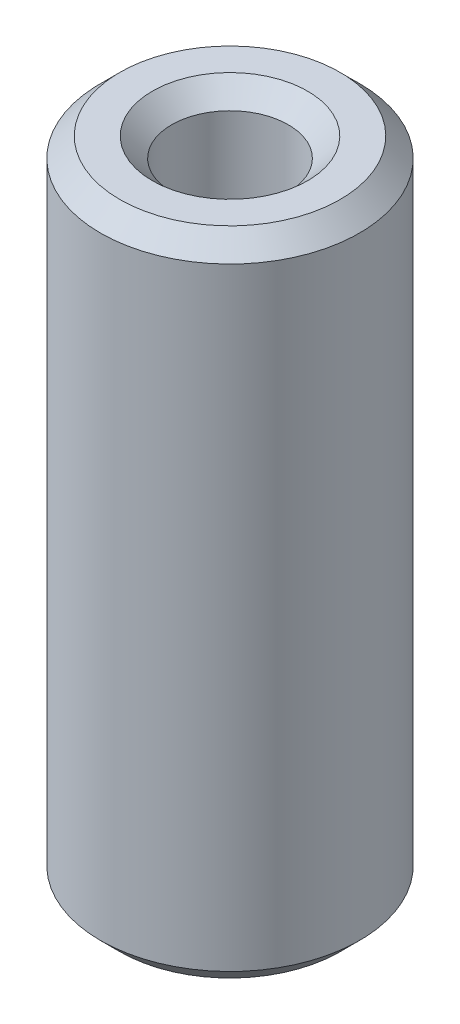
ISO-10303-21;
HEADER;
FILE_DESCRIPTION(('STEP AP214'),'2;1');
FILE_NAME('part.step','',(''),(''),'','','');
FILE_SCHEMA(('AUTOMOTIVE_DESIGN { 1 0 10303 214 1 1 1 1 }'));
ENDSEC;
DATA;
#1=APPLICATION_CONTEXT('core data for automotive mechanical design processes');
#2=APPLICATION_PROTOCOL_DEFINITION('international standard','automotive_design',2000,#1);
#3=PRODUCT_CONTEXT('',#1,'mechanical');
#4=PRODUCT('Part','Part','',(#3));
#5=PRODUCT_RELATED_PRODUCT_CATEGORY('part','',(#4));
#6=PRODUCT_DEFINITION_FORMATION('','',#4);
#7=PRODUCT_DEFINITION_CONTEXT('part definition',#1,'design');
#8=PRODUCT_DEFINITION('design','',#6,#7);
#9=PRODUCT_DEFINITION_SHAPE('','',#8);
#10=(LENGTH_UNIT() NAMED_UNIT(*) SI_UNIT(.MILLI.,.METRE.));
#11=(NAMED_UNIT(*) PLANE_ANGLE_UNIT() SI_UNIT($,.RADIAN.));
#12=(NAMED_UNIT(*) SI_UNIT($,.STERADIAN.) SOLID_ANGLE_UNIT());
#13=UNCERTAINTY_MEASURE_WITH_UNIT(LENGTH_MEASURE(1.E-05),#10,'distance_accuracy_value','');
#14=(GEOMETRIC_REPRESENTATION_CONTEXT(3) GLOBAL_UNCERTAINTY_ASSIGNED_CONTEXT((#13)) GLOBAL_UNIT_ASSIGNED_CONTEXT((#10,
#11,#12)) REPRESENTATION_CONTEXT('',''));
#15=CARTESIAN_POINT('',(0.,0.,0.));
#16=DIRECTION('',(0.,0.,1.));
#17=DIRECTION('',(1.,0.,0.));
#18=AXIS2_PLACEMENT_3D('',#15,#16,#17);
#19=CARTESIAN_POINT('',(0.,125.725835537299,0.));
#20=DIRECTION('',(0.,-1.,0.));
#21=DIRECTION('',(0.,0.,-1.));
#22=AXIS2_PLACEMENT_3D('',#19,#20,#21);
#23=CYLINDRICAL_SURFACE('',#22,25.);
#24=CARTESIAN_POINT('',(0.,3.73929303125158,0.));
#25=DIRECTION('',(0.,1.,0.));
#26=DIRECTION('',(0.,0.,1.));
#27=AXIS2_PLACEMENT_3D('',#24,#25,#26);
#28=CIRCLE('',#27,25.);
#29=CARTESIAN_POINT('',(0.,3.73929303125158,25.));
#30=VERTEX_POINT('',#29);
#31=EDGE_CURVE('E10',#30,#30,#28,.T.);
#32=ORIENTED_EDGE('',*,*,#31,.T.);
#33=EDGE_LOOP('',(#32));
#34=FACE_BOUND('',#33,.T.);
#35=CARTESIAN_POINT('',(0.,121.986542506047,0.));
#36=DIRECTION('',(0.,1.,0.));
#37=DIRECTION('',(0.,0.,1.));
#38=AXIS2_PLACEMENT_3D('',#35,#36,#37);
#39=CIRCLE('',#38,25.);
#40=CARTESIAN_POINT('',(0.,121.986542506047,25.));
#41=VERTEX_POINT('',#40);
#42=EDGE_CURVE('E50',#41,#41,#39,.F.);
#43=ORIENTED_EDGE('',*,*,#42,.T.);
#44=EDGE_LOOP('',(#43));
#45=FACE_BOUND('',#44,.T.);
#46=ADVANCED_FACE('F39',(#34,#45),#23,.T.);
#47=CARTESIAN_POINT('',(0.,125.725835537299,0.));
#48=DIRECTION('',(0.,1.,0.));
#49=DIRECTION('',(0.,0.,1.));
#50=AXIS2_PLACEMENT_3D('',#47,#48,#49);
#51=PLANE('',#50);
#52=CARTESIAN_POINT('',(0.,125.725835537299,0.));
#53=DIRECTION('',(0.,1.,0.));
#54=DIRECTION('',(0.,0.,1.));
#55=AXIS2_PLACEMENT_3D('',#52,#53,#54);
#56=CIRCLE('',#55,14.9864333976984);
#57=CARTESIAN_POINT('',(0.,125.725835537299,14.9864333976984));
#58=VERTEX_POINT('',#57);
#59=EDGE_CURVE('E58',#58,#58,#56,.F.);
#60=ORIENTED_EDGE('',*,*,#59,.T.);
#61=EDGE_LOOP('',(#60));
#62=FACE_BOUND('',#61,.T.);
#63=CARTESIAN_POINT('',(0.,125.725835537299,0.));
#64=DIRECTION('',(0.,1.,0.));
#65=DIRECTION('',(0.,0.,1.));
#66=AXIS2_PLACEMENT_3D('',#63,#64,#65);
#67=CIRCLE('',#66,21.2607069687484);
#68=CARTESIAN_POINT('',(0.,125.725835537299,21.2607069687484));
#69=VERTEX_POINT('',#68);
#70=EDGE_CURVE('E61',#69,#69,#67,.T.);
#71=ORIENTED_EDGE('',*,*,#70,.T.);
#72=EDGE_LOOP('',(#71));
#73=FACE_BOUND('',#72,.T.);
#74=ADVANCED_FACE('F88',(#62,#73),#51,.T.);
#75=CARTESIAN_POINT('',(0.,0.,0.));
#76=DIRECTION('',(0.,1.,0.));
#77=DIRECTION('',(0.,0.,1.));
#78=AXIS2_PLACEMENT_3D('',#75,#76,#77);
#79=PLANE('',#78);
#80=CARTESIAN_POINT('',(0.,0.,0.));
#81=DIRECTION('',(0.,1.,0.));
#82=DIRECTION('',(0.,0.,1.));
#83=AXIS2_PLACEMENT_3D('',#80,#81,#82);
#84=CIRCLE('',#83,14.9864333976985);
#85=CARTESIAN_POINT('',(0.,0.,14.9864333976985));
#86=VERTEX_POINT('',#85);
#87=EDGE_CURVE('E51',#86,#86,#84,.T.);
#88=ORIENTED_EDGE('',*,*,#87,.T.);
#89=EDGE_LOOP('',(#88));
#90=FACE_BOUND('',#89,.T.);
#91=CARTESIAN_POINT('',(0.,0.,0.));
#92=DIRECTION('',(0.,1.,0.));
#93=DIRECTION('',(0.,0.,1.));
#94=AXIS2_PLACEMENT_3D('',#91,#92,#93);
#95=CIRCLE('',#94,21.2607069687484);
#96=CARTESIAN_POINT('',(0.,0.,21.2607069687484));
#97=VERTEX_POINT('',#96);
#98=EDGE_CURVE('E54',#97,#97,#95,.F.);
#99=ORIENTED_EDGE('',*,*,#98,.T.);
#100=EDGE_LOOP('',(#99));
#101=FACE_BOUND('',#100,.T.);
#102=ADVANCED_FACE('F83',(#90,#101),#79,.F.);
#103=CARTESIAN_POINT('',(0.,125.725835537299,0.));
#104=DIRECTION('',(0.,-1.,0.));
#105=DIRECTION('',(0.,0.,-1.));
#106=AXIS2_PLACEMENT_3D('',#103,#104,#105);
#107=CYLINDRICAL_SURFACE('',#106,11.2471403664469);
#108=CARTESIAN_POINT('',(0.,121.986542506047,0.));
#109=DIRECTION('',(0.,1.,0.));
#110=DIRECTION('',(0.,0.,1.));
#111=AXIS2_PLACEMENT_3D('',#108,#109,#110);
#112=CIRCLE('',#111,11.2471403664469);
#113=CARTESIAN_POINT('',(0.,121.986542506047,11.2471403664469));
#114=VERTEX_POINT('',#113);
#115=EDGE_CURVE('E67',#114,#114,#112,.T.);
#116=ORIENTED_EDGE('',*,*,#115,.T.);
#117=EDGE_LOOP('',(#116));
#118=FACE_BOUND('',#117,.T.);
#119=CARTESIAN_POINT('',(0.,3.73929303125158,0.));
#120=DIRECTION('',(0.,1.,0.));
#121=DIRECTION('',(0.,0.,1.));
#122=AXIS2_PLACEMENT_3D('',#119,#120,#121);
#123=CIRCLE('',#122,11.2471403664469);
#124=CARTESIAN_POINT('',(0.,3.73929303125158,11.2471403664469));
#125=VERTEX_POINT('',#124);
#126=EDGE_CURVE('E69',#125,#125,#123,.F.);
#127=ORIENTED_EDGE('',*,*,#126,.T.);
#128=EDGE_LOOP('',(#127));
#129=FACE_BOUND('',#128,.T.);
#130=ADVANCED_FACE('F71',(#118,#129),#107,.F.);
#131=CARTESIAN_POINT('',(0.,121.986542506047,0.));
#132=DIRECTION('',(0.,1.,0.));
#133=DIRECTION('',(0.,0.,1.));
#134=AXIS2_PLACEMENT_3D('',#131,#132,#133);
#135=CONICAL_SURFACE('',#134,11.2471403664469,0.785398163397446);
#136=ORIENTED_EDGE('',*,*,#59,.F.);
#137=EDGE_LOOP('',(#136));
#138=FACE_BOUND('',#137,.T.);
#139=ORIENTED_EDGE('',*,*,#115,.F.);
#140=EDGE_LOOP('',(#139));
#141=FACE_BOUND('',#140,.T.);
#142=ADVANCED_FACE('F77',(#138,#141),#135,.F.);
#143=CARTESIAN_POINT('',(0.,0.,0.));
#144=DIRECTION('',(0.,-1.,0.));
#145=DIRECTION('',(0.,0.,-1.));
#146=AXIS2_PLACEMENT_3D('',#143,#144,#145);
#147=CONICAL_SURFACE('',#146,14.9864333976985,0.785398163397446);
#148=ORIENTED_EDGE('',*,*,#126,.F.);
#149=EDGE_LOOP('',(#148));
#150=FACE_BOUND('',#149,.T.);
#151=ORIENTED_EDGE('',*,*,#87,.F.);
#152=EDGE_LOOP('',(#151));
#153=FACE_BOUND('',#152,.T.);
#154=ADVANCED_FACE('F73',(#150,#153),#147,.F.);
#155=CARTESIAN_POINT('',(0.,3.73929303125158,0.));
#156=DIRECTION('',(0.,1.,0.));
#157=DIRECTION('',(0.,0.,1.));
#158=AXIS2_PLACEMENT_3D('',#155,#156,#157);
#159=CONICAL_SURFACE('',#158,25.,0.785398163397452);
#160=ORIENTED_EDGE('',*,*,#98,.F.);
#161=EDGE_LOOP('',(#160));
#162=FACE_BOUND('',#161,.T.);
#163=ORIENTED_EDGE('',*,*,#31,.F.);
#164=EDGE_LOOP('',(#163));
#165=FACE_BOUND('',#164,.T.);
#166=ADVANCED_FACE('F76',(#162,#165),#159,.T.);
#167=CARTESIAN_POINT('',(0.,125.725835537299,0.));
#168=DIRECTION('',(0.,-1.,0.));
#169=DIRECTION('',(0.,0.,-1.));
#170=AXIS2_PLACEMENT_3D('',#167,#168,#169);
#171=CONICAL_SURFACE('',#170,21.2607069687484,0.785398163397444);
#172=ORIENTED_EDGE('',*,*,#42,.F.);
#173=EDGE_LOOP('',(#172));
#174=FACE_BOUND('',#173,.T.);
#175=ORIENTED_EDGE('',*,*,#70,.F.);
#176=EDGE_LOOP('',(#175));
#177=FACE_BOUND('',#176,.T.);
#178=ADVANCED_FACE('F45',(#174,#177),#171,.T.);
#179=CLOSED_SHELL('',(#46,#74,#102,#130,#142,#154,#166,#178));
#180=MANIFOLD_SOLID_BREP('B2',#179);
#181=ADVANCED_BREP_SHAPE_REPRESENTATION('',(#18,#180),#14);
#182=SHAPE_DEFINITION_REPRESENTATION(#9,#181);
ENDSEC;
END-ISO-10303-21;
